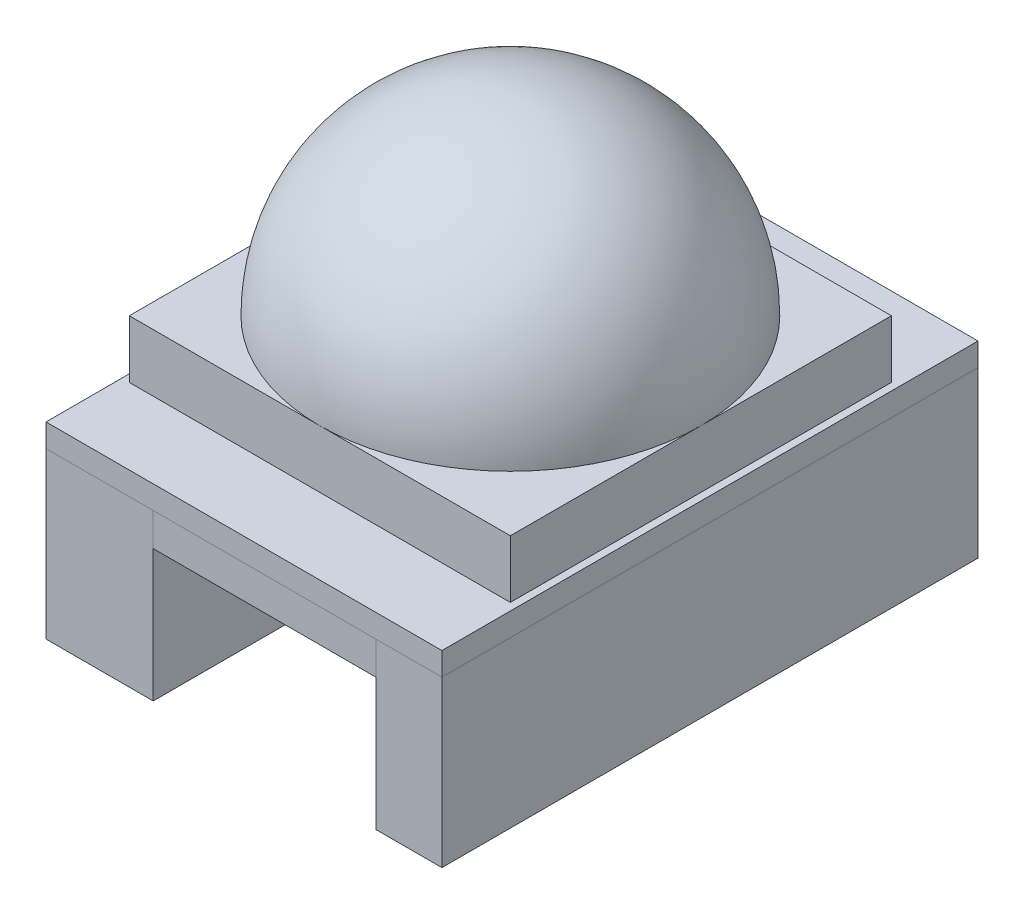
ISO-10303-21;
HEADER;
FILE_DESCRIPTION(('STEP AP214'),'2;1');
FILE_NAME('part.step','',(''),(''),'','','');
FILE_SCHEMA(('AUTOMOTIVE_DESIGN { 1 0 10303 214 1 1 1 1 }'));
ENDSEC;
DATA;
#1=APPLICATION_CONTEXT('core data for automotive mechanical design processes');
#2=APPLICATION_PROTOCOL_DEFINITION('international standard','automotive_design',2000,#1);
#3=PRODUCT_CONTEXT('',#1,'mechanical');
#4=PRODUCT('Part','Part','',(#3));
#5=PRODUCT_RELATED_PRODUCT_CATEGORY('part','',(#4));
#6=PRODUCT_DEFINITION_FORMATION('','',#4);
#7=PRODUCT_DEFINITION_CONTEXT('part definition',#1,'design');
#8=PRODUCT_DEFINITION('design','',#6,#7);
#9=PRODUCT_DEFINITION_SHAPE('','',#8);
#10=(LENGTH_UNIT() NAMED_UNIT(*) SI_UNIT(.MILLI.,.METRE.));
#11=(NAMED_UNIT(*) PLANE_ANGLE_UNIT() SI_UNIT($,.RADIAN.));
#12=(NAMED_UNIT(*) SI_UNIT($,.STERADIAN.) SOLID_ANGLE_UNIT());
#13=UNCERTAINTY_MEASURE_WITH_UNIT(LENGTH_MEASURE(1.E-05),#10,'distance_accuracy_value','');
#14=(GEOMETRIC_REPRESENTATION_CONTEXT(3) GLOBAL_UNCERTAINTY_ASSIGNED_CONTEXT((#13)) GLOBAL_UNIT_ASSIGNED_CONTEXT((#10,
#11,#12)) REPRESENTATION_CONTEXT('',''));
#15=CARTESIAN_POINT('',(0.,0.,0.));
#16=DIRECTION('',(0.,0.,1.));
#17=DIRECTION('',(1.,0.,0.));
#18=AXIS2_PLACEMENT_3D('',#15,#16,#17);
#19=CARTESIAN_POINT('',(-3.93923240938167,-2.,25.8987206823028));
#20=DIRECTION('',(1.,0.,0.));
#21=DIRECTION('',(0.,0.,-1.));
#22=AXIS2_PLACEMENT_3D('',#19,#20,#21);
#23=PLANE('',#22);
#24=DIRECTION('',(0.,0.,-1.));
#25=VECTOR('',#24,1.);
#26=CARTESIAN_POINT('',(-3.93923240938167,0.,25.8987206823028));
#27=LINE('',#26,#25);
#28=CARTESIAN_POINT('',(-3.93923240938167,0.,25.8987206823028));
#29=VERTEX_POINT('',#28);
#30=CARTESIAN_POINT('',(-3.93923240938167,0.,-6.60127931769723));
#31=VERTEX_POINT('',#30);
#32=EDGE_CURVE('E113',#29,#31,#27,.T.);
#33=ORIENTED_EDGE('',*,*,#32,.T.);
#34=DIRECTION('',(0.,1.,0.));
#35=VECTOR('',#34,1.);
#36=CARTESIAN_POINT('',(-3.93923240938167,-2.,-6.60127931769723));
#37=LINE('',#36,#35);
#38=CARTESIAN_POINT('',(-3.93923240938167,-2.,-6.60127931769723));
#39=VERTEX_POINT('',#38);
#40=EDGE_CURVE('E12',#39,#31,#37,.T.);
#41=ORIENTED_EDGE('',*,*,#40,.F.);
#42=DIRECTION('',(0.,0.,-1.));
#43=VECTOR('',#42,1.);
#44=CARTESIAN_POINT('',(-3.93923240938167,-2.,25.8987206823028));
#45=LINE('',#44,#43);
#46=CARTESIAN_POINT('',(-3.93923240938167,-2.,25.8987206823028));
#47=VERTEX_POINT('',#46);
#48=EDGE_CURVE('E101',#47,#39,#45,.T.);
#49=ORIENTED_EDGE('',*,*,#48,.F.);
#50=DIRECTION('',(0.,1.,0.));
#51=VECTOR('',#50,1.);
#52=CARTESIAN_POINT('',(-3.93923240938167,-2.,25.8987206823028));
#53=LINE('',#52,#51);
#54=EDGE_CURVE('E109',#47,#29,#53,.T.);
#55=ORIENTED_EDGE('',*,*,#54,.T.);
#56=EDGE_LOOP('',(#33,#41,#49,#55));
#57=FACE_BOUND('',#56,.T.);
#58=ADVANCED_FACE('F50',(#57),#23,.F.);
#59=CARTESIAN_POINT('',(-3.93923240938167,-2.,-6.60127931769723));
#60=DIRECTION('',(0.,0.,1.));
#61=DIRECTION('',(1.,0.,0.));
#62=AXIS2_PLACEMENT_3D('',#59,#60,#61);
#63=PLANE('',#62);
#64=DIRECTION('',(1.,0.,0.));
#65=VECTOR('',#64,1.);
#66=CARTESIAN_POINT('',(-3.93923240938167,0.,-6.60127931769723));
#67=LINE('',#66,#65);
#68=CARTESIAN_POINT('',(9.56076759061834,0.,-6.60127931769723));
#69=VERTEX_POINT('',#68);
#70=EDGE_CURVE('E105',#31,#69,#67,.T.);
#71=ORIENTED_EDGE('',*,*,#70,.T.);
#72=DIRECTION('',(0.,1.,0.));
#73=VECTOR('',#72,1.);
#74=CARTESIAN_POINT('',(9.56076759061834,-2.,-6.60127931769723));
#75=LINE('',#74,#73);
#76=CARTESIAN_POINT('',(9.56076759061834,-2.,-6.60127931769723));
#77=VERTEX_POINT('',#76);
#78=EDGE_CURVE('E58',#77,#69,#75,.T.);
#79=ORIENTED_EDGE('',*,*,#78,.F.);
#80=DIRECTION('',(1.,0.,0.));
#81=VECTOR('',#80,1.);
#82=CARTESIAN_POINT('',(-3.93923240938167,-2.,-6.60127931769723));
#83=LINE('',#82,#81);
#84=EDGE_CURVE('E96',#39,#77,#83,.T.);
#85=ORIENTED_EDGE('',*,*,#84,.F.);
#86=ORIENTED_EDGE('',*,*,#40,.T.);
#87=EDGE_LOOP('',(#71,#79,#85,#86));
#88=FACE_BOUND('',#87,.T.);
#89=ADVANCED_FACE('F104',(#88),#63,.F.);
#90=CARTESIAN_POINT('',(9.56076759061834,-2.,25.8987206823028));
#91=DIRECTION('',(-1.,0.,0.));
#92=DIRECTION('',(0.,0.,1.));
#93=AXIS2_PLACEMENT_3D('',#90,#91,#92);
#94=PLANE('',#93);
#95=DIRECTION('',(0.,0.,1.));
#96=VECTOR('',#95,1.);
#97=CARTESIAN_POINT('',(9.56076759061834,0.,25.8987206823028));
#98=LINE('',#97,#96);
#99=CARTESIAN_POINT('',(9.56076759061834,0.,25.8987206823028));
#100=VERTEX_POINT('',#99);
#101=EDGE_CURVE('E83',#69,#100,#98,.T.);
#102=ORIENTED_EDGE('',*,*,#101,.T.);
#103=DIRECTION('',(0.,1.,0.));
#104=VECTOR('',#103,1.);
#105=CARTESIAN_POINT('',(9.56076759061834,-2.,25.8987206823028));
#106=LINE('',#105,#104);
#107=CARTESIAN_POINT('',(9.56076759061834,-2.,25.8987206823028));
#108=VERTEX_POINT('',#107);
#109=EDGE_CURVE('E106',#108,#100,#106,.T.);
#110=ORIENTED_EDGE('',*,*,#109,.F.);
#111=DIRECTION('',(0.,0.,1.));
#112=VECTOR('',#111,1.);
#113=CARTESIAN_POINT('',(9.56076759061834,-2.,25.8987206823028));
#114=LINE('',#113,#112);
#115=EDGE_CURVE('E99',#77,#108,#114,.T.);
#116=ORIENTED_EDGE('',*,*,#115,.F.);
#117=ORIENTED_EDGE('',*,*,#78,.T.);
#118=EDGE_LOOP('',(#102,#110,#116,#117));
#119=FACE_BOUND('',#118,.T.);
#120=ADVANCED_FACE('F107',(#119),#94,.F.);
#121=CARTESIAN_POINT('',(-3.93923240938167,-2.,25.8987206823028));
#122=DIRECTION('',(0.,0.,-1.));
#123=DIRECTION('',(-1.,0.,0.));
#124=AXIS2_PLACEMENT_3D('',#121,#122,#123);
#125=PLANE('',#124);
#126=DIRECTION('',(-1.,0.,0.));
#127=VECTOR('',#126,1.);
#128=CARTESIAN_POINT('',(-3.93923240938167,0.,25.8987206823028));
#129=LINE('',#128,#127);
#130=EDGE_CURVE('E89',#100,#29,#129,.T.);
#131=ORIENTED_EDGE('',*,*,#130,.T.);
#132=ORIENTED_EDGE('',*,*,#54,.F.);
#133=DIRECTION('',(-1.,0.,0.));
#134=VECTOR('',#133,1.);
#135=CARTESIAN_POINT('',(-3.93923240938167,-2.,25.8987206823028));
#136=LINE('',#135,#134);
#137=EDGE_CURVE('E66',#108,#47,#136,.T.);
#138=ORIENTED_EDGE('',*,*,#137,.F.);
#139=ORIENTED_EDGE('',*,*,#109,.T.);
#140=EDGE_LOOP('',(#131,#132,#138,#139));
#141=FACE_BOUND('',#140,.T.);
#142=ADVANCED_FACE('F120',(#141),#125,.F.);
#143=CARTESIAN_POINT('',(0.,-2.,0.));
#144=DIRECTION('',(0.,-1.,0.));
#145=DIRECTION('',(0.,0.,-1.));
#146=AXIS2_PLACEMENT_3D('',#143,#144,#145);
#147=PLANE('',#146);
#148=ORIENTED_EDGE('',*,*,#48,.T.);
#149=ORIENTED_EDGE('',*,*,#84,.T.);
#150=ORIENTED_EDGE('',*,*,#115,.T.);
#151=ORIENTED_EDGE('',*,*,#137,.T.);
#152=EDGE_LOOP('',(#148,#149,#150,#151));
#153=FACE_BOUND('',#152,.T.);
#154=ADVANCED_FACE('F97',(#153),#147,.T.);
#155=CARTESIAN_POINT('',(0.,0.,0.));
#156=DIRECTION('',(0.,-1.,0.));
#157=DIRECTION('',(0.,0.,-1.));
#158=AXIS2_PLACEMENT_3D('',#155,#156,#157);
#159=PLANE('',#158);
#160=ORIENTED_EDGE('',*,*,#32,.F.);
#161=ORIENTED_EDGE('',*,*,#130,.F.);
#162=ORIENTED_EDGE('',*,*,#101,.F.);
#163=ORIENTED_EDGE('',*,*,#70,.F.);
#164=EDGE_LOOP('',(#160,#161,#162,#163));
#165=FACE_BOUND('',#164,.T.);
#166=ADVANCED_FACE('F123',(#165),#159,.F.);
#167=CLOSED_SHELL('',(#58,#89,#120,#142,#154,#166));
#168=MANIFOLD_SOLID_BREP('B2',#167);
#169=CARTESIAN_POINT('',(13.5607675906183,-10.,25.8987206823028));
#170=DIRECTION('',(-1.,0.,0.));
#171=DIRECTION('',(0.,0.,1.));
#172=AXIS2_PLACEMENT_3D('',#169,#170,#171);
#173=PLANE('',#172);
#174=DIRECTION('',(0.,0.,1.));
#175=VECTOR('',#174,1.);
#176=CARTESIAN_POINT('',(13.5607675906183,0.,25.8987206823028));
#177=LINE('',#176,#175);
#178=CARTESIAN_POINT('',(13.5607675906183,0.,-6.60127931769723));
#179=VERTEX_POINT('',#178);
#180=CARTESIAN_POINT('',(13.5607675906183,0.,25.8987206823028));
#181=VERTEX_POINT('',#180);
#182=EDGE_CURVE('E247',#179,#181,#177,.T.);
#183=ORIENTED_EDGE('',*,*,#182,.T.);
#184=DIRECTION('',(0.,1.,0.));
#185=VECTOR('',#184,1.);
#186=CARTESIAN_POINT('',(13.5607675906183,-10.,25.8987206823028));
#187=LINE('',#186,#185);
#188=CARTESIAN_POINT('',(13.5607675906183,-10.,25.8987206823028));
#189=VERTEX_POINT('',#188);
#190=EDGE_CURVE('E48',#189,#181,#187,.T.);
#191=ORIENTED_EDGE('',*,*,#190,.F.);
#192=DIRECTION('',(0.,0.,1.));
#193=VECTOR('',#192,1.);
#194=CARTESIAN_POINT('',(13.5607675906183,-10.,25.8987206823028));
#195=LINE('',#194,#193);
#196=CARTESIAN_POINT('',(13.5607675906183,-10.,-6.60127931769723));
#197=VERTEX_POINT('',#196);
#198=EDGE_CURVE('E235',#197,#189,#195,.T.);
#199=ORIENTED_EDGE('',*,*,#198,.F.);
#200=DIRECTION('',(0.,1.,0.));
#201=VECTOR('',#200,1.);
#202=CARTESIAN_POINT('',(13.5607675906183,-10.,-6.60127931769723));
#203=LINE('',#202,#201);
#204=EDGE_CURVE('E243',#197,#179,#203,.T.);
#205=ORIENTED_EDGE('',*,*,#204,.T.);
#206=EDGE_LOOP('',(#183,#191,#199,#205));
#207=FACE_BOUND('',#206,.T.);
#208=ADVANCED_FACE('F184',(#207),#173,.F.);
#209=CARTESIAN_POINT('',(13.5607675906183,-10.,25.8987206823028));
#210=DIRECTION('',(0.,0.,-1.));
#211=DIRECTION('',(-1.,0.,0.));
#212=AXIS2_PLACEMENT_3D('',#209,#210,#211);
#213=PLANE('',#212);
#214=DIRECTION('',(-1.,0.,0.));
#215=VECTOR('',#214,1.);
#216=CARTESIAN_POINT('',(13.5607675906183,0.,25.8987206823028));
#217=LINE('',#216,#215);
#218=CARTESIAN_POINT('',(9.56076759061833,0.,25.8987206823028));
#219=VERTEX_POINT('',#218);
#220=EDGE_CURVE('E239',#181,#219,#217,.T.);
#221=ORIENTED_EDGE('',*,*,#220,.T.);
#222=DIRECTION('',(0.,1.,0.));
#223=VECTOR('',#222,1.);
#224=CARTESIAN_POINT('',(9.56076759061833,-10.,25.8987206823028));
#225=LINE('',#224,#223);
#226=CARTESIAN_POINT('',(9.56076759061833,-10.,25.8987206823028));
#227=VERTEX_POINT('',#226);
#228=EDGE_CURVE('E192',#227,#219,#225,.T.);
#229=ORIENTED_EDGE('',*,*,#228,.F.);
#230=DIRECTION('',(-1.,0.,0.));
#231=VECTOR('',#230,1.);
#232=CARTESIAN_POINT('',(13.5607675906183,-10.,25.8987206823028));
#233=LINE('',#232,#231);
#234=EDGE_CURVE('E230',#189,#227,#233,.T.);
#235=ORIENTED_EDGE('',*,*,#234,.F.);
#236=ORIENTED_EDGE('',*,*,#190,.T.);
#237=EDGE_LOOP('',(#221,#229,#235,#236));
#238=FACE_BOUND('',#237,.T.);
#239=ADVANCED_FACE('F238',(#238),#213,.F.);
#240=CARTESIAN_POINT('',(9.56076759061833,-10.,25.8987206823028));
#241=DIRECTION('',(1.,0.,0.));
#242=DIRECTION('',(0.,0.,-1.));
#243=AXIS2_PLACEMENT_3D('',#240,#241,#242);
#244=PLANE('',#243);
#245=DIRECTION('',(0.,0.,-1.));
#246=VECTOR('',#245,1.);
#247=CARTESIAN_POINT('',(9.56076759061833,0.,25.8987206823028));
#248=LINE('',#247,#246);
#249=CARTESIAN_POINT('',(9.56076759061834,0.,-6.60127931769723));
#250=VERTEX_POINT('',#249);
#251=EDGE_CURVE('E217',#219,#250,#248,.T.);
#252=ORIENTED_EDGE('',*,*,#251,.T.);
#253=DIRECTION('',(0.,1.,0.));
#254=VECTOR('',#253,1.);
#255=CARTESIAN_POINT('',(9.56076759061834,-10.,-6.60127931769723));
#256=LINE('',#255,#254);
#257=CARTESIAN_POINT('',(9.56076759061834,-10.,-6.60127931769723));
#258=VERTEX_POINT('',#257);
#259=EDGE_CURVE('E240',#258,#250,#256,.T.);
#260=ORIENTED_EDGE('',*,*,#259,.F.);
#261=DIRECTION('',(0.,0.,-1.));
#262=VECTOR('',#261,1.);
#263=CARTESIAN_POINT('',(9.56076759061833,-10.,25.8987206823028));
#264=LINE('',#263,#262);
#265=EDGE_CURVE('E233',#227,#258,#264,.T.);
#266=ORIENTED_EDGE('',*,*,#265,.F.);
#267=ORIENTED_EDGE('',*,*,#228,.T.);
#268=EDGE_LOOP('',(#252,#260,#266,#267));
#269=FACE_BOUND('',#268,.T.);
#270=ADVANCED_FACE('F241',(#269),#244,.F.);
#271=CARTESIAN_POINT('',(13.5607675906183,-10.,-6.60127931769723));
#272=DIRECTION('',(0.,0.,1.));
#273=DIRECTION('',(1.,0.,0.));
#274=AXIS2_PLACEMENT_3D('',#271,#272,#273);
#275=PLANE('',#274);
#276=DIRECTION('',(1.,0.,0.));
#277=VECTOR('',#276,1.);
#278=CARTESIAN_POINT('',(13.5607675906183,0.,-6.60127931769723));
#279=LINE('',#278,#277);
#280=EDGE_CURVE('E223',#250,#179,#279,.T.);
#281=ORIENTED_EDGE('',*,*,#280,.T.);
#282=ORIENTED_EDGE('',*,*,#204,.F.);
#283=DIRECTION('',(1.,0.,0.));
#284=VECTOR('',#283,1.);
#285=CARTESIAN_POINT('',(13.5607675906183,-10.,-6.60127931769723));
#286=LINE('',#285,#284);
#287=EDGE_CURVE('E200',#258,#197,#286,.T.);
#288=ORIENTED_EDGE('',*,*,#287,.F.);
#289=ORIENTED_EDGE('',*,*,#259,.T.);
#290=EDGE_LOOP('',(#281,#282,#288,#289));
#291=FACE_BOUND('',#290,.T.);
#292=ADVANCED_FACE('F254',(#291),#275,.F.);
#293=CARTESIAN_POINT('',(0.,-10.,0.));
#294=DIRECTION('',(0.,1.,0.));
#295=DIRECTION('',(0.,0.,1.));
#296=AXIS2_PLACEMENT_3D('',#293,#294,#295);
#297=PLANE('',#296);
#298=ORIENTED_EDGE('',*,*,#198,.T.);
#299=ORIENTED_EDGE('',*,*,#234,.T.);
#300=ORIENTED_EDGE('',*,*,#265,.T.);
#301=ORIENTED_EDGE('',*,*,#287,.T.);
#302=EDGE_LOOP('',(#298,#299,#300,#301));
#303=FACE_BOUND('',#302,.T.);
#304=ADVANCED_FACE('F231',(#303),#297,.F.);
#305=CARTESIAN_POINT('',(0.,0.,0.));
#306=DIRECTION('',(0.,1.,0.));
#307=DIRECTION('',(0.,0.,1.));
#308=AXIS2_PLACEMENT_3D('',#305,#306,#307);
#309=PLANE('',#308);
#310=ORIENTED_EDGE('',*,*,#182,.F.);
#311=ORIENTED_EDGE('',*,*,#280,.F.);
#312=ORIENTED_EDGE('',*,*,#251,.F.);
#313=ORIENTED_EDGE('',*,*,#220,.F.);
#314=EDGE_LOOP('',(#310,#311,#312,#313));
#315=FACE_BOUND('',#314,.T.);
#316=ADVANCED_FACE('F257',(#315),#309,.T.);
#317=CLOSED_SHELL('',(#208,#239,#270,#292,#304,#316));
#318=MANIFOLD_SOLID_BREP('B6',#317);
#319=CARTESIAN_POINT('',(-10.4392324093817,-10.,25.8987206823028));
#320=DIRECTION('',(1.,0.,0.));
#321=DIRECTION('',(0.,0.,-1.));
#322=AXIS2_PLACEMENT_3D('',#319,#320,#321);
#323=PLANE('',#322);
#324=DIRECTION('',(0.,0.,-1.));
#325=VECTOR('',#324,1.);
#326=CARTESIAN_POINT('',(-10.4392324093817,0.,25.8987206823028));
#327=LINE('',#326,#325);
#328=CARTESIAN_POINT('',(-10.4392324093817,0.,25.8987206823028));
#329=VERTEX_POINT('',#328);
#330=CARTESIAN_POINT('',(-10.4392324093817,0.,-6.60127931769723));
#331=VERTEX_POINT('',#330);
#332=EDGE_CURVE('E380',#329,#331,#327,.T.);
#333=ORIENTED_EDGE('',*,*,#332,.T.);
#334=DIRECTION('',(0.,1.,0.));
#335=VECTOR('',#334,1.);
#336=CARTESIAN_POINT('',(-10.4392324093817,-10.,-6.60127931769723));
#337=LINE('',#336,#335);
#338=CARTESIAN_POINT('',(-10.4392324093817,-10.,-6.60127931769723));
#339=VERTEX_POINT('',#338);
#340=EDGE_CURVE('E182',#339,#331,#337,.T.);
#341=ORIENTED_EDGE('',*,*,#340,.F.);
#342=DIRECTION('',(0.,0.,-1.));
#343=VECTOR('',#342,1.);
#344=CARTESIAN_POINT('',(-10.4392324093817,-10.,25.8987206823028));
#345=LINE('',#344,#343);
#346=CARTESIAN_POINT('',(-10.4392324093817,-10.,25.8987206823028));
#347=VERTEX_POINT('',#346);
#348=EDGE_CURVE('E368',#347,#339,#345,.T.);
#349=ORIENTED_EDGE('',*,*,#348,.F.);
#350=DIRECTION('',(0.,1.,0.));
#351=VECTOR('',#350,1.);
#352=CARTESIAN_POINT('',(-10.4392324093817,-10.,25.8987206823028));
#353=LINE('',#352,#351);
#354=EDGE_CURVE('E376',#347,#329,#353,.T.);
#355=ORIENTED_EDGE('',*,*,#354,.T.);
#356=EDGE_LOOP('',(#333,#341,#349,#355));
#357=FACE_BOUND('',#356,.T.);
#358=ADVANCED_FACE('F317',(#357),#323,.F.);
#359=CARTESIAN_POINT('',(-10.4392324093817,-10.,-6.60127931769723));
#360=DIRECTION('',(0.,0.,1.));
#361=DIRECTION('',(1.,0.,0.));
#362=AXIS2_PLACEMENT_3D('',#359,#360,#361);
#363=PLANE('',#362);
#364=DIRECTION('',(1.,0.,0.));
#365=VECTOR('',#364,1.);
#366=CARTESIAN_POINT('',(-10.4392324093817,0.,-6.60127931769723));
#367=LINE('',#366,#365);
#368=CARTESIAN_POINT('',(-3.93923240938166,0.,-6.60127931769723));
#369=VERTEX_POINT('',#368);
#370=EDGE_CURVE('E372',#331,#369,#367,.T.);
#371=ORIENTED_EDGE('',*,*,#370,.T.);
#372=DIRECTION('',(0.,1.,0.));
#373=VECTOR('',#372,1.);
#374=CARTESIAN_POINT('',(-3.93923240938166,-10.,-6.60127931769723));
#375=LINE('',#374,#373);
#376=CARTESIAN_POINT('',(-3.93923240938166,-10.,-6.60127931769723));
#377=VERTEX_POINT('',#376);
#378=EDGE_CURVE('E325',#377,#369,#375,.T.);
#379=ORIENTED_EDGE('',*,*,#378,.F.);
#380=DIRECTION('',(1.,0.,0.));
#381=VECTOR('',#380,1.);
#382=CARTESIAN_POINT('',(-10.4392324093817,-10.,-6.60127931769723));
#383=LINE('',#382,#381);
#384=EDGE_CURVE('E363',#339,#377,#383,.T.);
#385=ORIENTED_EDGE('',*,*,#384,.F.);
#386=ORIENTED_EDGE('',*,*,#340,.T.);
#387=EDGE_LOOP('',(#371,#379,#385,#386));
#388=FACE_BOUND('',#387,.T.);
#389=ADVANCED_FACE('F371',(#388),#363,.F.);
#390=CARTESIAN_POINT('',(-3.93923240938167,-10.,25.8987206823028));
#391=DIRECTION('',(-1.,0.,0.));
#392=DIRECTION('',(0.,0.,1.));
#393=AXIS2_PLACEMENT_3D('',#390,#391,#392);
#394=PLANE('',#393);
#395=DIRECTION('',(0.,0.,1.));
#396=VECTOR('',#395,1.);
#397=CARTESIAN_POINT('',(-3.93923240938167,0.,25.8987206823028));
#398=LINE('',#397,#396);
#399=CARTESIAN_POINT('',(-3.93923240938167,0.,25.8987206823028));
#400=VERTEX_POINT('',#399);
#401=EDGE_CURVE('E350',#369,#400,#398,.T.);
#402=ORIENTED_EDGE('',*,*,#401,.T.);
#403=DIRECTION('',(0.,1.,0.));
#404=VECTOR('',#403,1.);
#405=CARTESIAN_POINT('',(-3.93923240938167,-10.,25.8987206823028));
#406=LINE('',#405,#404);
#407=CARTESIAN_POINT('',(-3.93923240938167,-10.,25.8987206823028));
#408=VERTEX_POINT('',#407);
#409=EDGE_CURVE('E373',#408,#400,#406,.T.);
#410=ORIENTED_EDGE('',*,*,#409,.F.);
#411=DIRECTION('',(0.,0.,1.));
#412=VECTOR('',#411,1.);
#413=CARTESIAN_POINT('',(-3.93923240938167,-10.,25.8987206823028));
#414=LINE('',#413,#412);
#415=EDGE_CURVE('E366',#377,#408,#414,.T.);
#416=ORIENTED_EDGE('',*,*,#415,.F.);
#417=ORIENTED_EDGE('',*,*,#378,.T.);
#418=EDGE_LOOP('',(#402,#410,#416,#417));
#419=FACE_BOUND('',#418,.T.);
#420=ADVANCED_FACE('F374',(#419),#394,.F.);
#421=CARTESIAN_POINT('',(-10.4392324093817,-10.,25.8987206823028));
#422=DIRECTION('',(0.,0.,-1.));
#423=DIRECTION('',(-1.,0.,0.));
#424=AXIS2_PLACEMENT_3D('',#421,#422,#423);
#425=PLANE('',#424);
#426=DIRECTION('',(-1.,0.,0.));
#427=VECTOR('',#426,1.);
#428=CARTESIAN_POINT('',(-10.4392324093817,0.,25.8987206823028));
#429=LINE('',#428,#427);
#430=EDGE_CURVE('E356',#400,#329,#429,.T.);
#431=ORIENTED_EDGE('',*,*,#430,.T.);
#432=ORIENTED_EDGE('',*,*,#354,.F.);
#433=DIRECTION('',(-1.,0.,0.));
#434=VECTOR('',#433,1.);
#435=CARTESIAN_POINT('',(-10.4392324093817,-10.,25.8987206823028));
#436=LINE('',#435,#434);
#437=EDGE_CURVE('E333',#408,#347,#436,.T.);
#438=ORIENTED_EDGE('',*,*,#437,.F.);
#439=ORIENTED_EDGE('',*,*,#409,.T.);
#440=EDGE_LOOP('',(#431,#432,#438,#439));
#441=FACE_BOUND('',#440,.T.);
#442=ADVANCED_FACE('F387',(#441),#425,.F.);
#443=CARTESIAN_POINT('',(0.,-10.,0.));
#444=DIRECTION('',(0.,-1.,0.));
#445=DIRECTION('',(0.,0.,-1.));
#446=AXIS2_PLACEMENT_3D('',#443,#444,#445);
#447=PLANE('',#446);
#448=ORIENTED_EDGE('',*,*,#348,.T.);
#449=ORIENTED_EDGE('',*,*,#384,.T.);
#450=ORIENTED_EDGE('',*,*,#415,.T.);
#451=ORIENTED_EDGE('',*,*,#437,.T.);
#452=EDGE_LOOP('',(#448,#449,#450,#451));
#453=FACE_BOUND('',#452,.T.);
#454=ADVANCED_FACE('F364',(#453),#447,.T.);
#455=CARTESIAN_POINT('',(0.,0.,0.));
#456=DIRECTION('',(0.,-1.,0.));
#457=DIRECTION('',(0.,0.,-1.));
#458=AXIS2_PLACEMENT_3D('',#455,#456,#457);
#459=PLANE('',#458);
#460=ORIENTED_EDGE('',*,*,#332,.F.);
#461=ORIENTED_EDGE('',*,*,#430,.F.);
#462=ORIENTED_EDGE('',*,*,#401,.F.);
#463=ORIENTED_EDGE('',*,*,#370,.F.);
#464=EDGE_LOOP('',(#460,#461,#462,#463));
#465=FACE_BOUND('',#464,.T.);
#466=ADVANCED_FACE('F390',(#465),#459,.F.);
#467=CLOSED_SHELL('',(#358,#389,#420,#442,#454,#466));
#468=MANIFOLD_SOLID_BREP('B42',#467);
#469=CARTESIAN_POINT('',(0.,4.9,0.));
#470=DIRECTION('',(0.,1.,0.));
#471=DIRECTION('',(0.,0.,1.));
#472=AXIS2_PLACEMENT_3D('',#469,#470,#471);
#473=PLANE('',#472);
#474=DIRECTION('',(1.,0.,0.));
#475=VECTOR('',#474,1.);
#476=CARTESIAN_POINT('',(-9.98923240938167,4.9,21.2987206823028));
#477=LINE('',#476,#475);
#478=CARTESIAN_POINT('',(-9.98923240938167,4.9,21.2987206823028));
#479=VERTEX_POINT('',#478);
#480=CARTESIAN_POINT('',(1.56076759061833,4.9,21.2987206823028));
#481=VERTEX_POINT('',#480);
#482=EDGE_CURVE('E631',#479,#481,#477,.T.);
#483=ORIENTED_EDGE('',*,*,#482,.T.);
#484=CARTESIAN_POINT('',(1.56076759061833,4.9,9.74872068230276));
#485=DIRECTION('',(0.,1.,0.));
#486=DIRECTION('',(0.,0.,1.));
#487=AXIS2_PLACEMENT_3D('',#484,#485,#486);
#488=CIRCLE('',#487,11.55);
#489=CARTESIAN_POINT('',(-9.98923240938167,4.9,9.74872068230277));
#490=VERTEX_POINT('',#489);
#491=EDGE_CURVE('E315',#481,#490,#488,.F.);
#492=ORIENTED_EDGE('',*,*,#491,.T.);
#493=DIRECTION('',(0.,0.,1.));
#494=VECTOR('',#493,1.);
#495=CARTESIAN_POINT('',(-9.98923240938167,4.9,-1.80127931769724));
#496=LINE('',#495,#494);
#497=EDGE_CURVE('E565',#490,#479,#496,.T.);
#498=ORIENTED_EDGE('',*,*,#497,.T.);
#499=EDGE_LOOP('',(#483,#492,#498));
#500=FACE_BOUND('',#499,.T.);
#501=ADVANCED_FACE('F441',(#500),#473,.T.);
#502=CARTESIAN_POINT('',(-9.98923240938167,4.9,-1.80127931769724));
#503=VERTEX_POINT('',#502);
#504=EDGE_CURVE('E531',#503,#490,#496,.T.);
#505=ORIENTED_EDGE('',*,*,#504,.T.);
#506=CARTESIAN_POINT('',(1.56076759061833,4.9,-1.80127931769724));
#507=VERTEX_POINT('',#506);
#508=EDGE_CURVE('E451',#490,#507,#488,.F.);
#509=ORIENTED_EDGE('',*,*,#508,.T.);
#510=DIRECTION('',(-1.,0.,0.));
#511=VECTOR('',#510,1.);
#512=CARTESIAN_POINT('',(-9.98923240938167,4.9,-1.80127931769724));
#513=LINE('',#512,#511);
#514=EDGE_CURVE('E528',#507,#503,#513,.T.);
#515=ORIENTED_EDGE('',*,*,#514,.T.);
#516=EDGE_LOOP('',(#505,#509,#515));
#517=FACE_BOUND('',#516,.T.);
#518=ADVANCED_FACE('F527',(#517),#473,.T.);
#519=CARTESIAN_POINT('',(13.1107675906183,4.9,-1.80127931769724));
#520=VERTEX_POINT('',#519);
#521=EDGE_CURVE('E537',#520,#507,#513,.T.);
#522=ORIENTED_EDGE('',*,*,#521,.T.);
#523=CARTESIAN_POINT('',(1.56076759061833,4.9,9.74872068230276));
#524=DIRECTION('',(0.,-1.,0.));
#525=DIRECTION('',(0.,0.,-1.));
#526=AXIS2_PLACEMENT_3D('',#523,#524,#525);
#527=CIRCLE('',#526,11.55);
#528=CARTESIAN_POINT('',(13.1107675906183,4.9,9.74872068230276));
#529=VERTEX_POINT('',#528);
#530=EDGE_CURVE('E516',#507,#529,#527,.T.);
#531=ORIENTED_EDGE('',*,*,#530,.T.);
#532=DIRECTION('',(0.,0.,-1.));
#533=VECTOR('',#532,1.);
#534=CARTESIAN_POINT('',(13.1107675906183,4.9,-1.80127931769724));
#535=LINE('',#534,#533);
#536=EDGE_CURVE('E544',#529,#520,#535,.T.);
#537=ORIENTED_EDGE('',*,*,#536,.T.);
#538=EDGE_LOOP('',(#522,#531,#537));
#539=FACE_BOUND('',#538,.T.);
#540=ADVANCED_FACE('F543',(#539),#473,.T.);
#541=CARTESIAN_POINT('',(-10.4392324093817,1.4,-6.60127931769723));
#542=DIRECTION('',(1.,0.,0.));
#543=DIRECTION('',(0.,0.,-1.));
#544=AXIS2_PLACEMENT_3D('',#541,#542,#543);
#545=PLANE('',#544);
#546=DIRECTION('',(0.,0.,1.));
#547=VECTOR('',#546,1.);
#548=CARTESIAN_POINT('',(-10.4392324093817,0.,-6.60127931769723));
#549=LINE('',#548,#547);
#550=CARTESIAN_POINT('',(-10.4392324093817,0.,-6.60127931769723));
#551=VERTEX_POINT('',#550);
#552=CARTESIAN_POINT('',(-10.4392324093817,0.,25.8987206823028));
#553=VERTEX_POINT('',#552);
#554=EDGE_CURVE('E577',#551,#553,#549,.T.);
#555=ORIENTED_EDGE('',*,*,#554,.T.);
#556=DIRECTION('',(0.,-1.,0.));
#557=VECTOR('',#556,1.);
#558=CARTESIAN_POINT('',(-10.4392324093817,1.4,25.8987206823028));
#559=LINE('',#558,#557);
#560=CARTESIAN_POINT('',(-10.4392324093817,1.4,25.8987206823028));
#561=VERTEX_POINT('',#560);
#562=EDGE_CURVE('E614',#561,#553,#559,.T.);
#563=ORIENTED_EDGE('',*,*,#562,.F.);
#564=DIRECTION('',(0.,0.,1.));
#565=VECTOR('',#564,1.);
#566=CARTESIAN_POINT('',(-10.4392324093817,1.4,-6.60127931769723));
#567=LINE('',#566,#565);
#568=CARTESIAN_POINT('',(-10.4392324093817,1.4,-6.60127931769723));
#569=VERTEX_POINT('',#568);
#570=EDGE_CURVE('E578',#569,#561,#567,.T.);
#571=ORIENTED_EDGE('',*,*,#570,.F.);
#572=DIRECTION('',(0.,-1.,0.));
#573=VECTOR('',#572,1.);
#574=CARTESIAN_POINT('',(-10.4392324093817,1.4,-6.60127931769723));
#575=LINE('',#574,#573);
#576=EDGE_CURVE('E592',#569,#551,#575,.T.);
#577=ORIENTED_EDGE('',*,*,#576,.T.);
#578=EDGE_LOOP('',(#555,#563,#571,#577));
#579=FACE_BOUND('',#578,.T.);
#580=ADVANCED_FACE('F443',(#579),#545,.F.);
#581=CARTESIAN_POINT('',(-10.4392324093817,1.4,25.8987206823028));
#582=DIRECTION('',(0.,0.,-1.));
#583=DIRECTION('',(-1.,0.,0.));
#584=AXIS2_PLACEMENT_3D('',#581,#582,#583);
#585=PLANE('',#584);
#586=DIRECTION('',(1.,0.,0.));
#587=VECTOR('',#586,1.);
#588=CARTESIAN_POINT('',(-10.4392324093817,0.,25.8987206823028));
#589=LINE('',#588,#587);
#590=CARTESIAN_POINT('',(13.5607675906183,0.,25.8987206823028));
#591=VERTEX_POINT('',#590);
#592=EDGE_CURVE('E596',#553,#591,#589,.T.);
#593=ORIENTED_EDGE('',*,*,#592,.T.);
#594=DIRECTION('',(0.,-1.,0.));
#595=VECTOR('',#594,1.);
#596=CARTESIAN_POINT('',(13.5607675906183,1.4,25.8987206823028));
#597=LINE('',#596,#595);
#598=CARTESIAN_POINT('',(13.5607675906183,1.4,25.8987206823028));
#599=VERTEX_POINT('',#598);
#600=EDGE_CURVE('E611',#599,#591,#597,.T.);
#601=ORIENTED_EDGE('',*,*,#600,.F.);
#602=DIRECTION('',(1.,0.,0.));
#603=VECTOR('',#602,1.);
#604=CARTESIAN_POINT('',(-10.4392324093817,1.4,25.8987206823028));
#605=LINE('',#604,#603);
#606=EDGE_CURVE('E582',#561,#599,#605,.T.);
#607=ORIENTED_EDGE('',*,*,#606,.F.);
#608=ORIENTED_EDGE('',*,*,#562,.T.);
#609=EDGE_LOOP('',(#593,#601,#607,#608));
#610=FACE_BOUND('',#609,.T.);
#611=ADVANCED_FACE('F661',(#610),#585,.F.);
#612=CARTESIAN_POINT('',(13.5607675906183,1.4,-6.60127931769723));
#613=DIRECTION('',(-1.,0.,0.));
#614=DIRECTION('',(0.,0.,1.));
#615=AXIS2_PLACEMENT_3D('',#612,#613,#614);
#616=PLANE('',#615);
#617=DIRECTION('',(0.,0.,-1.));
#618=VECTOR('',#617,1.);
#619=CARTESIAN_POINT('',(13.5607675906183,0.,-6.60127931769723));
#620=LINE('',#619,#618);
#621=CARTESIAN_POINT('',(13.5607675906183,0.,-6.60127931769723));
#622=VERTEX_POINT('',#621);
#623=EDGE_CURVE('E599',#591,#622,#620,.T.);
#624=ORIENTED_EDGE('',*,*,#623,.T.);
#625=DIRECTION('',(0.,-1.,0.));
#626=VECTOR('',#625,1.);
#627=CARTESIAN_POINT('',(13.5607675906183,1.4,-6.60127931769723));
#628=LINE('',#627,#626);
#629=CARTESIAN_POINT('',(13.5607675906183,1.4,-6.60127931769723));
#630=VERTEX_POINT('',#629);
#631=EDGE_CURVE('E607',#630,#622,#628,.T.);
#632=ORIENTED_EDGE('',*,*,#631,.F.);
#633=DIRECTION('',(0.,0.,-1.));
#634=VECTOR('',#633,1.);
#635=CARTESIAN_POINT('',(13.5607675906183,1.4,-6.60127931769723));
#636=LINE('',#635,#634);
#637=EDGE_CURVE('E586',#599,#630,#636,.T.);
#638=ORIENTED_EDGE('',*,*,#637,.F.);
#639=ORIENTED_EDGE('',*,*,#600,.T.);
#640=EDGE_LOOP('',(#624,#632,#638,#639));
#641=FACE_BOUND('',#640,.T.);
#642=ADVANCED_FACE('F664',(#641),#616,.F.);
#643=CARTESIAN_POINT('',(-10.4392324093817,1.4,-6.60127931769723));
#644=DIRECTION('',(0.,0.,1.));
#645=DIRECTION('',(1.,0.,0.));
#646=AXIS2_PLACEMENT_3D('',#643,#644,#645);
#647=PLANE('',#646);
#648=DIRECTION('',(-1.,0.,0.));
#649=VECTOR('',#648,1.);
#650=CARTESIAN_POINT('',(-10.4392324093817,0.,-6.60127931769723));
#651=LINE('',#650,#649);
#652=EDGE_CURVE('E583',#622,#551,#651,.T.);
#653=ORIENTED_EDGE('',*,*,#652,.T.);
#654=ORIENTED_EDGE('',*,*,#576,.F.);
#655=DIRECTION('',(-1.,0.,0.));
#656=VECTOR('',#655,1.);
#657=CARTESIAN_POINT('',(-10.4392324093817,1.4,-6.60127931769723));
#658=LINE('',#657,#656);
#659=EDGE_CURVE('E589',#630,#569,#658,.T.);
#660=ORIENTED_EDGE('',*,*,#659,.F.);
#661=ORIENTED_EDGE('',*,*,#631,.T.);
#662=EDGE_LOOP('',(#653,#654,#660,#661));
#663=FACE_BOUND('',#662,.T.);
#664=ADVANCED_FACE('F650',(#663),#647,.F.);
#665=CARTESIAN_POINT('',(0.,1.4,0.));
#666=DIRECTION('',(0.,1.,0.));
#667=DIRECTION('',(0.,0.,1.));
#668=AXIS2_PLACEMENT_3D('',#665,#666,#667);
#669=PLANE('',#668);
#670=DIRECTION('',(0.,0.,1.));
#671=VECTOR('',#670,1.);
#672=CARTESIAN_POINT('',(-9.98923240938167,1.4,-1.80127931769724));
#673=LINE('',#672,#671);
#674=CARTESIAN_POINT('',(-9.98923240938167,1.4,-1.80127931769724));
#675=VERTEX_POINT('',#674);
#676=CARTESIAN_POINT('',(-9.98923240938167,1.4,21.2987206823028));
#677=VERTEX_POINT('',#676);
#678=EDGE_CURVE('E464',#675,#677,#673,.T.);
#679=ORIENTED_EDGE('',*,*,#678,.F.);
#680=DIRECTION('',(-1.,0.,0.));
#681=VECTOR('',#680,1.);
#682=CARTESIAN_POINT('',(-9.98923240938167,1.4,-1.80127931769724));
#683=LINE('',#682,#681);
#684=CARTESIAN_POINT('',(13.1107675906183,1.4,-1.80127931769724));
#685=VERTEX_POINT('',#684);
#686=EDGE_CURVE('E563',#685,#675,#683,.T.);
#687=ORIENTED_EDGE('',*,*,#686,.F.);
#688=DIRECTION('',(0.,0.,-1.));
#689=VECTOR('',#688,1.);
#690=CARTESIAN_POINT('',(13.1107675906183,1.4,-1.80127931769724));
#691=LINE('',#690,#689);
#692=CARTESIAN_POINT('',(13.1107675906183,1.4,21.2987206823028));
#693=VERTEX_POINT('',#692);
#694=EDGE_CURVE('E559',#693,#685,#691,.T.);
#695=ORIENTED_EDGE('',*,*,#694,.F.);
#696=DIRECTION('',(1.,0.,0.));
#697=VECTOR('',#696,1.);
#698=CARTESIAN_POINT('',(-9.98923240938167,1.4,21.2987206823028));
#699=LINE('',#698,#697);
#700=EDGE_CURVE('E555',#677,#693,#699,.T.);
#701=ORIENTED_EDGE('',*,*,#700,.F.);
#702=EDGE_LOOP('',(#679,#687,#695,#701));
#703=FACE_BOUND('',#702,.T.);
#704=ORIENTED_EDGE('',*,*,#570,.T.);
#705=ORIENTED_EDGE('',*,*,#606,.T.);
#706=ORIENTED_EDGE('',*,*,#637,.T.);
#707=ORIENTED_EDGE('',*,*,#659,.T.);
#708=EDGE_LOOP('',(#704,#705,#706,#707));
#709=FACE_BOUND('',#708,.T.);
#710=ADVANCED_FACE('F646',(#703,#709),#669,.T.);
#711=CARTESIAN_POINT('',(0.,0.,0.));
#712=DIRECTION('',(0.,1.,0.));
#713=DIRECTION('',(0.,0.,1.));
#714=AXIS2_PLACEMENT_3D('',#711,#712,#713);
#715=PLANE('',#714);
#716=ORIENTED_EDGE('',*,*,#554,.F.);
#717=ORIENTED_EDGE('',*,*,#652,.F.);
#718=ORIENTED_EDGE('',*,*,#623,.F.);
#719=ORIENTED_EDGE('',*,*,#592,.F.);
#720=EDGE_LOOP('',(#716,#717,#718,#719));
#721=FACE_BOUND('',#720,.T.);
#722=ADVANCED_FACE('F649',(#721),#715,.F.);
#723=CARTESIAN_POINT('',(-9.98923240938167,4.9,-1.80127931769724));
#724=DIRECTION('',(1.,0.,0.));
#725=DIRECTION('',(0.,0.,-1.));
#726=AXIS2_PLACEMENT_3D('',#723,#724,#725);
#727=PLANE('',#726);
#728=ORIENTED_EDGE('',*,*,#678,.T.);
#729=DIRECTION('',(0.,-1.,0.));
#730=VECTOR('',#729,1.);
#731=CARTESIAN_POINT('',(-9.98923240938167,4.9,21.2987206823028));
#732=LINE('',#731,#730);
#733=EDGE_CURVE('E573',#479,#677,#732,.T.);
#734=ORIENTED_EDGE('',*,*,#733,.F.);
#735=ORIENTED_EDGE('',*,*,#497,.F.);
#736=ORIENTED_EDGE('',*,*,#504,.F.);
#737=DIRECTION('',(0.,-1.,0.));
#738=VECTOR('',#737,1.);
#739=CARTESIAN_POINT('',(-9.98923240938167,4.9,-1.80127931769724));
#740=LINE('',#739,#738);
#741=EDGE_CURVE('E539',#503,#675,#740,.T.);
#742=ORIENTED_EDGE('',*,*,#741,.T.);
#743=EDGE_LOOP('',(#728,#734,#735,#736,#742));
#744=FACE_BOUND('',#743,.T.);
#745=ADVANCED_FACE('F643',(#744),#727,.F.);
#746=CARTESIAN_POINT('',(-9.98923240938167,4.9,21.2987206823028));
#747=DIRECTION('',(0.,0.,-1.));
#748=DIRECTION('',(-1.,0.,0.));
#749=AXIS2_PLACEMENT_3D('',#746,#747,#748);
#750=PLANE('',#749);
#751=ORIENTED_EDGE('',*,*,#700,.T.);
#752=DIRECTION('',(0.,-1.,0.));
#753=VECTOR('',#752,1.);
#754=CARTESIAN_POINT('',(13.1107675906183,4.9,21.2987206823028));
#755=LINE('',#754,#753);
#756=CARTESIAN_POINT('',(13.1107675906183,4.9,21.2987206823028));
#757=VERTEX_POINT('',#756);
#758=EDGE_CURVE('E569',#757,#693,#755,.T.);
#759=ORIENTED_EDGE('',*,*,#758,.F.);
#760=EDGE_CURVE('E624',#481,#757,#477,.T.);
#761=ORIENTED_EDGE('',*,*,#760,.F.);
#762=ORIENTED_EDGE('',*,*,#482,.F.);
#763=ORIENTED_EDGE('',*,*,#733,.T.);
#764=EDGE_LOOP('',(#751,#759,#761,#762,#763));
#765=FACE_BOUND('',#764,.T.);
#766=ADVANCED_FACE('F630',(#765),#750,.F.);
#767=CARTESIAN_POINT('',(13.1107675906183,4.9,-1.80127931769724));
#768=DIRECTION('',(-1.,0.,0.));
#769=DIRECTION('',(0.,0.,1.));
#770=AXIS2_PLACEMENT_3D('',#767,#768,#769);
#771=PLANE('',#770);
#772=ORIENTED_EDGE('',*,*,#694,.T.);
#773=DIRECTION('',(0.,-1.,0.));
#774=VECTOR('',#773,1.);
#775=CARTESIAN_POINT('',(13.1107675906183,4.9,-1.80127931769724));
#776=LINE('',#775,#774);
#777=EDGE_CURVE('E548',#520,#685,#776,.T.);
#778=ORIENTED_EDGE('',*,*,#777,.F.);
#779=ORIENTED_EDGE('',*,*,#536,.F.);
#780=EDGE_CURVE('E541',#757,#529,#535,.T.);
#781=ORIENTED_EDGE('',*,*,#780,.F.);
#782=ORIENTED_EDGE('',*,*,#758,.T.);
#783=EDGE_LOOP('',(#772,#778,#779,#781,#782));
#784=FACE_BOUND('',#783,.T.);
#785=ADVANCED_FACE('F645',(#784),#771,.F.);
#786=CARTESIAN_POINT('',(-9.98923240938167,4.9,-1.80127931769724));
#787=DIRECTION('',(0.,0.,1.));
#788=DIRECTION('',(1.,0.,0.));
#789=AXIS2_PLACEMENT_3D('',#786,#787,#788);
#790=PLANE('',#789);
#791=ORIENTED_EDGE('',*,*,#686,.T.);
#792=ORIENTED_EDGE('',*,*,#741,.F.);
#793=ORIENTED_EDGE('',*,*,#514,.F.);
#794=ORIENTED_EDGE('',*,*,#521,.F.);
#795=ORIENTED_EDGE('',*,*,#777,.T.);
#796=EDGE_LOOP('',(#791,#792,#793,#794,#795));
#797=FACE_BOUND('',#796,.T.);
#798=ADVANCED_FACE('F535',(#797),#790,.F.);
#799=ORIENTED_EDGE('',*,*,#780,.T.);
#800=EDGE_CURVE('E445',#529,#481,#488,.F.);
#801=ORIENTED_EDGE('',*,*,#800,.T.);
#802=ORIENTED_EDGE('',*,*,#760,.T.);
#803=EDGE_LOOP('',(#799,#801,#802));
#804=FACE_BOUND('',#803,.T.);
#805=ADVANCED_FACE('F623',(#804),#473,.T.);
#806=CARTESIAN_POINT('',(1.56076759061833,4.9,9.74872068230276));
#807=DIRECTION('',(0.,-1.,0.));
#808=DIRECTION('',(1.,0.,0.));
#809=AXIS2_PLACEMENT_3D('',#806,#807,#808);
#810=SPHERICAL_SURFACE('',#809,11.55);
#811=ORIENTED_EDGE('',*,*,#530,.F.);
#812=ORIENTED_EDGE('',*,*,#508,.F.);
#813=ORIENTED_EDGE('',*,*,#491,.F.);
#814=ORIENTED_EDGE('',*,*,#800,.F.);
#815=EDGE_LOOP('',(#811,#812,#813,#814));
#816=FACE_BOUND('',#815,.T.);
#817=ADVANCED_FACE('F518',(#816),#810,.T.);
#818=CLOSED_SHELL('',(#501,#518,#540,#580,#611,#642,#664,#710,#722,#745,#766,#785,#798,#805,#817));
#819=MANIFOLD_SOLID_BREP('B176',#818);
#820=ADVANCED_BREP_SHAPE_REPRESENTATION('',(#18,#168,#318,#468,#819),#14);
#821=SHAPE_DEFINITION_REPRESENTATION(#9,#820);
ENDSEC;
END-ISO-10303-21;
